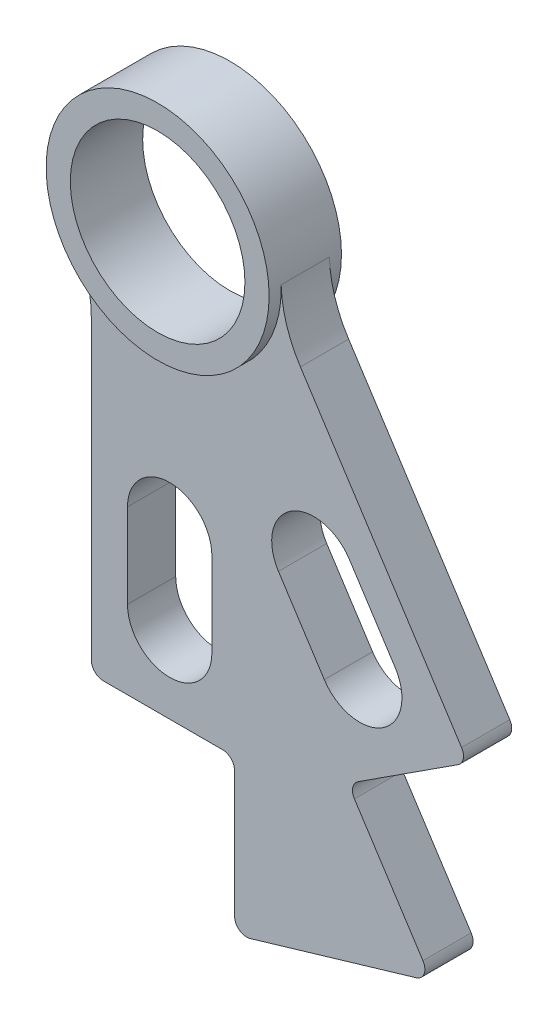
ISO-10303-21;
HEADER;
FILE_DESCRIPTION(('STEP AP214'),'2;1');
FILE_NAME('part.step','',(''),(''),'','','');
FILE_SCHEMA(('AUTOMOTIVE_DESIGN { 1 0 10303 214 1 1 1 1 }'));
ENDSEC;
DATA;
#1=APPLICATION_CONTEXT('core data for automotive mechanical design processes');
#2=APPLICATION_PROTOCOL_DEFINITION('international standard','automotive_design',2000,#1);
#3=PRODUCT_CONTEXT('',#1,'mechanical');
#4=PRODUCT('Part','Part','',(#3));
#5=PRODUCT_RELATED_PRODUCT_CATEGORY('part','',(#4));
#6=PRODUCT_DEFINITION_FORMATION('','',#4);
#7=PRODUCT_DEFINITION_CONTEXT('part definition',#1,'design');
#8=PRODUCT_DEFINITION('design','',#6,#7);
#9=PRODUCT_DEFINITION_SHAPE('','',#8);
#10=(LENGTH_UNIT() NAMED_UNIT(*) SI_UNIT(.MILLI.,.METRE.));
#11=(NAMED_UNIT(*) PLANE_ANGLE_UNIT() SI_UNIT($,.RADIAN.));
#12=(NAMED_UNIT(*) SI_UNIT($,.STERADIAN.) SOLID_ANGLE_UNIT());
#13=UNCERTAINTY_MEASURE_WITH_UNIT(LENGTH_MEASURE(1.E-05),#10,'distance_accuracy_value','');
#14=(GEOMETRIC_REPRESENTATION_CONTEXT(3) GLOBAL_UNCERTAINTY_ASSIGNED_CONTEXT((#13)) GLOBAL_UNIT_ASSIGNED_CONTEXT((#10,
#11,#12)) REPRESENTATION_CONTEXT('',''));
#15=CARTESIAN_POINT('',(0.,0.,0.));
#16=DIRECTION('',(0.,0.,1.));
#17=DIRECTION('',(1.,0.,0.));
#18=AXIS2_PLACEMENT_3D('',#15,#16,#17);
#19=CARTESIAN_POINT('',(0.,0.,4.7625));
#20=DIRECTION('',(0.,0.,-1.));
#21=DIRECTION('',(-1.,0.,0.));
#22=AXIS2_PLACEMENT_3D('',#19,#20,#21);
#23=CYLINDRICAL_SURFACE('',#22,11.495405);
#24=CARTESIAN_POINT('',(0.,0.,4.7625));
#25=DIRECTION('',(0.,0.,1.));
#26=DIRECTION('',(1.,0.,0.));
#27=AXIS2_PLACEMENT_3D('',#24,#25,#26);
#28=CIRCLE('',#27,11.495405);
#29=CARTESIAN_POINT('',(11.495405,0.,4.7625));
#30=VERTEX_POINT('',#29);
#31=EDGE_CURVE('E337',#30,#30,#28,.T.);
#32=ORIENTED_EDGE('',*,*,#31,.T.);
#33=EDGE_LOOP('',(#32));
#34=FACE_BOUND('',#33,.T.);
#35=CARTESIAN_POINT('',(0.,0.,-4.7625));
#36=DIRECTION('',(0.,0.,1.));
#37=DIRECTION('',(1.,0.,0.));
#38=AXIS2_PLACEMENT_3D('',#35,#36,#37);
#39=CIRCLE('',#38,11.495405);
#40=CARTESIAN_POINT('',(11.495405,0.,-4.7625));
#41=VERTEX_POINT('',#40);
#42=EDGE_CURVE('E325',#41,#41,#39,.T.);
#43=ORIENTED_EDGE('',*,*,#42,.F.);
#44=EDGE_LOOP('',(#43));
#45=FACE_BOUND('',#44,.T.);
#46=ADVANCED_FACE('F35',(#34,#45),#23,.F.);
#47=CARTESIAN_POINT('',(0.,0.,4.7625));
#48=DIRECTION('',(0.,0.,-1.));
#49=DIRECTION('',(-1.,0.,0.));
#50=AXIS2_PLACEMENT_3D('',#47,#48,#49);
#51=CYLINDRICAL_SURFACE('',#50,14.6812);
#52=DIRECTION('',(0.,0.,-1.));
#53=VECTOR('',#52,1.);
#54=CARTESIAN_POINT('',(-12.5851932668327,-7.5597978727258,3.175));
#55=LINE('',#54,#53);
#56=CARTESIAN_POINT('',(-12.5851932668327,-7.5597978727258,3.175));
#57=VERTEX_POINT('',#56);
#58=CARTESIAN_POINT('',(-12.5851932668327,-7.5597978727258,-3.175));
#59=VERTEX_POINT('',#58);
#60=EDGE_CURVE('E333',#57,#59,#55,.T.);
#61=ORIENTED_EDGE('',*,*,#60,.F.);
#62=CARTESIAN_POINT('',(0.,0.,3.175));
#63=DIRECTION('',(0.,0.,1.));
#64=DIRECTION('',(1.,0.,0.));
#65=AXIS2_PLACEMENT_3D('',#62,#63,#64);
#66=CIRCLE('',#65,14.6812);
#67=CARTESIAN_POINT('',(14.6729838648991,0.491098707400019,3.175));
#68=VERTEX_POINT('',#67);
#69=EDGE_CURVE('E225',#57,#68,#66,.T.);
#70=ORIENTED_EDGE('',*,*,#69,.T.);
#71=DIRECTION('',(0.,0.,-1.));
#72=VECTOR('',#71,1.);
#73=CARTESIAN_POINT('',(14.6729838648991,0.491098707400019,3.175));
#74=LINE('',#73,#72);
#75=CARTESIAN_POINT('',(14.6729838648991,0.491098707400019,-3.175));
#76=VERTEX_POINT('',#75);
#77=EDGE_CURVE('E222',#68,#76,#74,.T.);
#78=ORIENTED_EDGE('',*,*,#77,.T.);
#79=CARTESIAN_POINT('',(0.,0.,-3.175));
#80=DIRECTION('',(0.,0.,1.));
#81=DIRECTION('',(1.,0.,0.));
#82=AXIS2_PLACEMENT_3D('',#79,#80,#81);
#83=CIRCLE('',#82,14.6812);
#84=EDGE_CURVE('E274',#59,#76,#83,.T.);
#85=ORIENTED_EDGE('',*,*,#84,.F.);
#86=EDGE_LOOP('',(#61,#70,#78,#85));
#87=FACE_BOUND('',#86,.T.);
#88=CARTESIAN_POINT('',(0.,0.,4.7625));
#89=DIRECTION('',(0.,0.,1.));
#90=DIRECTION('',(1.,0.,0.));
#91=AXIS2_PLACEMENT_3D('',#88,#89,#90);
#92=CIRCLE('',#91,14.6812);
#93=CARTESIAN_POINT('',(14.6812,0.,4.7625));
#94=VERTEX_POINT('',#93);
#95=EDGE_CURVE('E340',#94,#94,#92,.T.);
#96=ORIENTED_EDGE('',*,*,#95,.F.);
#97=EDGE_LOOP('',(#96));
#98=FACE_BOUND('',#97,.T.);
#99=CARTESIAN_POINT('',(0.,0.,-4.7625));
#100=DIRECTION('',(0.,0.,1.));
#101=DIRECTION('',(1.,0.,0.));
#102=AXIS2_PLACEMENT_3D('',#99,#100,#101);
#103=CIRCLE('',#102,14.6812);
#104=CARTESIAN_POINT('',(14.6812,0.,-4.7625));
#105=VERTEX_POINT('',#104);
#106=EDGE_CURVE('E341',#105,#105,#103,.T.);
#107=ORIENTED_EDGE('',*,*,#106,.T.);
#108=EDGE_LOOP('',(#107));
#109=FACE_BOUND('',#108,.T.);
#110=ADVANCED_FACE('F438',(#87,#98,#109),#51,.T.);
#111=CARTESIAN_POINT('',(0.,0.,4.7625));
#112=DIRECTION('',(0.,0.,1.));
#113=DIRECTION('',(1.,0.,0.));
#114=AXIS2_PLACEMENT_3D('',#111,#112,#113);
#115=PLANE('',#114);
#116=ORIENTED_EDGE('',*,*,#31,.F.);
#117=EDGE_LOOP('',(#116));
#118=FACE_BOUND('',#117,.T.);
#119=ORIENTED_EDGE('',*,*,#95,.T.);
#120=EDGE_LOOP('',(#119));
#121=FACE_BOUND('',#120,.T.);
#122=ADVANCED_FACE('F463',(#118,#121),#115,.T.);
#123=CARTESIAN_POINT('',(0.,0.,-4.7625));
#124=DIRECTION('',(0.,0.,1.));
#125=DIRECTION('',(1.,0.,0.));
#126=AXIS2_PLACEMENT_3D('',#123,#124,#125);
#127=PLANE('',#126);
#128=ORIENTED_EDGE('',*,*,#42,.T.);
#129=EDGE_LOOP('',(#128));
#130=FACE_BOUND('',#129,.T.);
#131=ORIENTED_EDGE('',*,*,#106,.F.);
#132=EDGE_LOOP('',(#131));
#133=FACE_BOUND('',#132,.T.);
#134=ADVANCED_FACE('F672',(#130,#133),#127,.F.);
#135=CARTESIAN_POINT('',(0.,-34.9430697939241,3.175));
#136=DIRECTION('',(0.,0.,-1.));
#137=DIRECTION('',(-1.,0.,0.));
#138=AXIS2_PLACEMENT_3D('',#135,#136,#137);
#139=CYLINDRICAL_SURFACE('',#138,5.55625000000368);
#140=CARTESIAN_POINT('',(0.,-34.9430697939241,-3.175));
#141=DIRECTION('',(0.,0.,1.));
#142=DIRECTION('',(1.,0.,0.));
#143=AXIS2_PLACEMENT_3D('',#140,#141,#142);
#144=CIRCLE('',#143,5.55625000000368);
#145=CARTESIAN_POINT('',(5.55625000000371,-34.9430697939241,-3.175));
#146=VERTEX_POINT('',#145);
#147=CARTESIAN_POINT('',(-5.55625000000365,-34.9430697939241,-3.175));
#148=VERTEX_POINT('',#147);
#149=EDGE_CURVE('E303',#146,#148,#144,.T.);
#150=ORIENTED_EDGE('',*,*,#149,.F.);
#151=DIRECTION('',(0.,0.,-1.));
#152=VECTOR('',#151,1.);
#153=CARTESIAN_POINT('',(5.55625000000371,-34.9430697939241,3.175));
#154=LINE('',#153,#152);
#155=CARTESIAN_POINT('',(5.55625000000371,-34.9430697939241,3.175));
#156=VERTEX_POINT('',#155);
#157=EDGE_CURVE('E323',#156,#146,#154,.T.);
#158=ORIENTED_EDGE('',*,*,#157,.F.);
#159=CARTESIAN_POINT('',(0.,-34.9430697939241,3.175));
#160=DIRECTION('',(0.,0.,1.));
#161=DIRECTION('',(1.,0.,0.));
#162=AXIS2_PLACEMENT_3D('',#159,#160,#161);
#163=CIRCLE('',#162,5.55625000000368);
#164=CARTESIAN_POINT('',(-5.55625000000365,-34.9430697939241,3.175));
#165=VERTEX_POINT('',#164);
#166=EDGE_CURVE('E253',#156,#165,#163,.T.);
#167=ORIENTED_EDGE('',*,*,#166,.T.);
#168=DIRECTION('',(0.,0.,-1.));
#169=VECTOR('',#168,1.);
#170=CARTESIAN_POINT('',(-5.55625000000365,-34.9430697939241,3.175));
#171=LINE('',#170,#169);
#172=EDGE_CURVE('E316',#165,#148,#171,.T.);
#173=ORIENTED_EDGE('',*,*,#172,.T.);
#174=EDGE_LOOP('',(#150,#158,#167,#173));
#175=FACE_BOUND('',#174,.T.);
#176=ADVANCED_FACE('F662',(#175),#139,.F.);
#177=CARTESIAN_POINT('',(5.55625000000371,0.,3.175));
#178=DIRECTION('',(-1.,0.,0.));
#179=DIRECTION('',(0.,0.,1.));
#180=AXIS2_PLACEMENT_3D('',#177,#178,#179);
#181=PLANE('',#180);
#182=DIRECTION('',(0.,1.,0.));
#183=VECTOR('',#182,1.);
#184=CARTESIAN_POINT('',(5.55625000000371,0.,-3.175));
#185=LINE('',#184,#183);
#186=CARTESIAN_POINT('',(5.55625000000371,-46.0555697939241,-3.175));
#187=VERTEX_POINT('',#186);
#188=EDGE_CURVE('E306',#187,#146,#185,.T.);
#189=ORIENTED_EDGE('',*,*,#188,.F.);
#190=DIRECTION('',(0.,0.,-1.));
#191=VECTOR('',#190,1.);
#192=CARTESIAN_POINT('',(5.55625000000371,-46.0555697939241,3.175));
#193=LINE('',#192,#191);
#194=CARTESIAN_POINT('',(5.55625000000371,-46.0555697939241,3.175));
#195=VERTEX_POINT('',#194);
#196=EDGE_CURVE('E321',#195,#187,#193,.T.);
#197=ORIENTED_EDGE('',*,*,#196,.F.);
#198=DIRECTION('',(0.,1.,0.));
#199=VECTOR('',#198,1.);
#200=CARTESIAN_POINT('',(5.55625000000371,0.,3.175));
#201=LINE('',#200,#199);
#202=EDGE_CURVE('E256',#195,#156,#201,.T.);
#203=ORIENTED_EDGE('',*,*,#202,.T.);
#204=ORIENTED_EDGE('',*,*,#157,.T.);
#205=EDGE_LOOP('',(#189,#197,#203,#204));
#206=FACE_BOUND('',#205,.T.);
#207=ADVANCED_FACE('F652',(#206),#181,.T.);
#208=CARTESIAN_POINT('',(0.,-46.0555697939241,3.175));
#209=DIRECTION('',(0.,0.,-1.));
#210=DIRECTION('',(-1.,0.,0.));
#211=AXIS2_PLACEMENT_3D('',#208,#209,#210);
#212=CYLINDRICAL_SURFACE('',#211,5.55625000000368);
#213=CARTESIAN_POINT('',(0.,-46.0555697939241,-3.175));
#214=DIRECTION('',(0.,0.,1.));
#215=DIRECTION('',(1.,0.,0.));
#216=AXIS2_PLACEMENT_3D('',#213,#214,#215);
#217=CIRCLE('',#216,5.55625000000368);
#218=CARTESIAN_POINT('',(-5.55625000000365,-46.0555697939241,-3.175));
#219=VERTEX_POINT('',#218);
#220=EDGE_CURVE('E309',#219,#187,#217,.T.);
#221=ORIENTED_EDGE('',*,*,#220,.F.);
#222=DIRECTION('',(0.,0.,-1.));
#223=VECTOR('',#222,1.);
#224=CARTESIAN_POINT('',(-5.55625000000365,-46.0555697939241,3.175));
#225=LINE('',#224,#223);
#226=CARTESIAN_POINT('',(-5.55625000000365,-46.0555697939241,3.175));
#227=VERTEX_POINT('',#226);
#228=EDGE_CURVE('E318',#227,#219,#225,.T.);
#229=ORIENTED_EDGE('',*,*,#228,.F.);
#230=CARTESIAN_POINT('',(0.,-46.0555697939241,3.175));
#231=DIRECTION('',(0.,0.,1.));
#232=DIRECTION('',(1.,0.,0.));
#233=AXIS2_PLACEMENT_3D('',#230,#231,#232);
#234=CIRCLE('',#233,5.55625000000368);
#235=EDGE_CURVE('E259',#227,#195,#234,.T.);
#236=ORIENTED_EDGE('',*,*,#235,.T.);
#237=ORIENTED_EDGE('',*,*,#196,.T.);
#238=EDGE_LOOP('',(#221,#229,#236,#237));
#239=FACE_BOUND('',#238,.T.);
#240=ADVANCED_FACE('F642',(#239),#212,.F.);
#241=CARTESIAN_POINT('',(18.9851807063147,-29.3356615772007,3.175));
#242=DIRECTION('',(0.,0.,-1.));
#243=DIRECTION('',(-1.,0.,0.));
#244=AXIS2_PLACEMENT_3D('',#241,#242,#243);
#245=CYLINDRICAL_SURFACE('',#244,5.55625000000375);
#246=CARTESIAN_POINT('',(18.9851807063147,-29.3356615772007,-3.175));
#247=DIRECTION('',(0.,0.,1.));
#248=DIRECTION('',(1.,0.,0.));
#249=AXIS2_PLACEMENT_3D('',#246,#247,#248);
#250=CIRCLE('',#249,5.55625000000375);
#251=CARTESIAN_POINT('',(23.6498043527107,-26.3168538158445,-3.175));
#252=VERTEX_POINT('',#251);
#253=CARTESIAN_POINT('',(14.3205570599188,-32.3544693385572,-3.175));
#254=VERTEX_POINT('',#253);
#255=EDGE_CURVE('E291',#252,#254,#250,.T.);
#256=ORIENTED_EDGE('',*,*,#255,.F.);
#257=DIRECTION('',(0.,0.,-1.));
#258=VECTOR('',#257,1.);
#259=CARTESIAN_POINT('',(23.6498043527107,-26.3168538158445,3.175));
#260=LINE('',#259,#258);
#261=CARTESIAN_POINT('',(23.6498043527107,-26.3168538158445,3.175));
#262=VERTEX_POINT('',#261);
#263=EDGE_CURVE('E319',#262,#252,#260,.T.);
#264=ORIENTED_EDGE('',*,*,#263,.F.);
#265=CARTESIAN_POINT('',(18.9851807063147,-29.3356615772007,3.175));
#266=DIRECTION('',(0.,0.,1.));
#267=DIRECTION('',(1.,0.,0.));
#268=AXIS2_PLACEMENT_3D('',#265,#266,#267);
#269=CIRCLE('',#268,5.55625000000375);
#270=CARTESIAN_POINT('',(14.3205570599188,-32.3544693385572,3.175));
#271=VERTEX_POINT('',#270);
#272=EDGE_CURVE('E242',#262,#271,#269,.T.);
#273=ORIENTED_EDGE('',*,*,#272,.T.);
#274=DIRECTION('',(0.,0.,-1.));
#275=VECTOR('',#274,1.);
#276=CARTESIAN_POINT('',(14.3205570599188,-32.3544693385572,3.175));
#277=LINE('',#276,#275);
#278=EDGE_CURVE('E221',#271,#254,#277,.T.);
#279=ORIENTED_EDGE('',*,*,#278,.T.);
#280=EDGE_LOOP('',(#256,#264,#273,#279));
#281=FACE_BOUND('',#280,.T.);
#282=ADVANCED_FACE('F632',(#281),#245,.F.);
#283=CARTESIAN_POINT('',(4.66462364639593,3.0188077613563,3.175));
#284=DIRECTION('',(-0.839527315436279,-0.543317482358478,0.));
#285=DIRECTION('',(0.543317482358478,-0.839527315436279,0.));
#286=AXIS2_PLACEMENT_3D('',#283,#284,#285);
#287=PLANE('',#286);
#288=DIRECTION('',(-0.543317482358478,0.839527315436279,0.));
#289=VECTOR('',#288,1.);
#290=CARTESIAN_POINT('',(4.66462364639593,3.0188077613563,-3.175));
#291=LINE('',#290,#289);
#292=CARTESIAN_POINT('',(29.6874198754193,-35.6461011086302,-3.175));
#293=VERTEX_POINT('',#292);
#294=EDGE_CURVE('E294',#293,#252,#291,.T.);
#295=ORIENTED_EDGE('',*,*,#294,.F.);
#296=DIRECTION('',(0.,0.,-1.));
#297=VECTOR('',#296,1.);
#298=CARTESIAN_POINT('',(29.6874198754193,-35.6461011086302,3.175));
#299=LINE('',#298,#297);
#300=CARTESIAN_POINT('',(29.6874198754193,-35.6461011086302,3.175));
#301=VERTEX_POINT('',#300);
#302=EDGE_CURVE('E329',#301,#293,#299,.T.);
#303=ORIENTED_EDGE('',*,*,#302,.F.);
#304=DIRECTION('',(-0.543317482358478,0.839527315436279,0.));
#305=VECTOR('',#304,1.);
#306=CARTESIAN_POINT('',(4.66462364639593,3.0188077613563,3.175));
#307=LINE('',#306,#305);
#308=EDGE_CURVE('E245',#301,#262,#307,.T.);
#309=ORIENTED_EDGE('',*,*,#308,.T.);
#310=ORIENTED_EDGE('',*,*,#263,.T.);
#311=EDGE_LOOP('',(#295,#303,#309,#310));
#312=FACE_BOUND('',#311,.T.);
#313=ADVANCED_FACE('F622',(#312),#287,.T.);
#314=CARTESIAN_POINT('',(25.0227962290233,-38.6649088699864,3.175));
#315=DIRECTION('',(0.,0.,-1.));
#316=DIRECTION('',(-1.,0.,0.));
#317=AXIS2_PLACEMENT_3D('',#314,#315,#316);
#318=CYLINDRICAL_SURFACE('',#317,5.55625000000375);
#319=CARTESIAN_POINT('',(25.0227962290233,-38.6649088699864,-3.175));
#320=DIRECTION('',(0.,0.,1.));
#321=DIRECTION('',(1.,0.,0.));
#322=AXIS2_PLACEMENT_3D('',#319,#320,#321);
#323=CIRCLE('',#322,5.55625000000375);
#324=CARTESIAN_POINT('',(20.3581725826273,-41.6837166313428,-3.175));
#325=VERTEX_POINT('',#324);
#326=EDGE_CURVE('E297',#325,#293,#323,.T.);
#327=ORIENTED_EDGE('',*,*,#326,.F.);
#328=DIRECTION('',(0.,0.,-1.));
#329=VECTOR('',#328,1.);
#330=CARTESIAN_POINT('',(20.3581725826273,-41.6837166313428,3.175));
#331=LINE('',#330,#329);
#332=CARTESIAN_POINT('',(20.3581725826273,-41.6837166313428,3.175));
#333=VERTEX_POINT('',#332);
#334=EDGE_CURVE('E327',#333,#325,#331,.T.);
#335=ORIENTED_EDGE('',*,*,#334,.F.);
#336=CARTESIAN_POINT('',(25.0227962290233,-38.6649088699864,3.175));
#337=DIRECTION('',(0.,0.,1.));
#338=DIRECTION('',(1.,0.,0.));
#339=AXIS2_PLACEMENT_3D('',#336,#337,#338);
#340=CIRCLE('',#339,5.55625000000375);
#341=EDGE_CURVE('E248',#333,#301,#340,.T.);
#342=ORIENTED_EDGE('',*,*,#341,.T.);
#343=ORIENTED_EDGE('',*,*,#302,.T.);
#344=EDGE_LOOP('',(#327,#335,#342,#343));
#345=FACE_BOUND('',#344,.T.);
#346=ADVANCED_FACE('F588',(#345),#318,.F.);
#347=CARTESIAN_POINT('',(-7.17019291931249,-4.64033878745323,3.175));
#348=DIRECTION('',(0.839527315436278,0.543317482358478,0.));
#349=DIRECTION('',(-0.543317482358479,0.839527315436278,0.));
#350=AXIS2_PLACEMENT_3D('',#347,#348,#349);
#351=PLANE('',#350);
#352=DIRECTION('',(0.543317482358479,-0.839527315436278,0.));
#353=VECTOR('',#352,1.);
#354=CARTESIAN_POINT('',(-7.17019291931249,-4.64033878745323,3.175));
#355=LINE('',#354,#353);
#356=CARTESIAN_POINT('',(24.3214770840415,-53.3008697568528,3.175));
#357=VERTEX_POINT('',#356);
#358=CARTESIAN_POINT('',(33.3450702928547,-67.2440120781699,3.175));
#359=VERTEX_POINT('',#358);
#360=EDGE_CURVE('E315',#357,#359,#355,.T.);
#361=ORIENTED_EDGE('',*,*,#360,.T.);
#362=DIRECTION('',(0.,0.,-1.));
#363=VECTOR('',#362,1.);
#364=CARTESIAN_POINT('',(33.3450702928547,-67.2440120781699,-3.175));
#365=LINE('',#364,#363);
#366=CARTESIAN_POINT('',(33.3450702928547,-67.2440120781699,-3.175));
#367=VERTEX_POINT('',#366);
#368=EDGE_CURVE('E374',#359,#367,#365,.T.);
#369=ORIENTED_EDGE('',*,*,#368,.T.);
#370=DIRECTION('',(0.543317482358479,-0.839527315436278,0.));
#371=VECTOR('',#370,1.);
#372=CARTESIAN_POINT('',(-7.17019291931249,-4.64033878745323,-3.175));
#373=LINE('',#372,#371);
#374=CARTESIAN_POINT('',(24.3214770840415,-53.3008697568528,-3.175));
#375=VERTEX_POINT('',#374);
#376=EDGE_CURVE('E265',#375,#367,#373,.T.);
#377=ORIENTED_EDGE('',*,*,#376,.F.);
#378=DIRECTION('',(0.,0.,-1.));
#379=VECTOR('',#378,1.);
#380=CARTESIAN_POINT('',(24.3214770840415,-53.3008697568528,3.175));
#381=LINE('',#380,#379);
#382=EDGE_CURVE('E372',#375,#357,#381,.F.);
#383=ORIENTED_EDGE('',*,*,#382,.T.);
#384=EDGE_LOOP('',(#361,#369,#377,#383));
#385=FACE_BOUND('',#384,.T.);
#386=ADVANCED_FACE('F425',(#385),#351,.T.);
#387=CARTESIAN_POINT('',(30.6291535001097,-47.3277813561446,3.175));
#388=DIRECTION('',(-0.543317482358476,0.83952731543628,0.));
#389=DIRECTION('',(-0.83952731543628,-0.543317482358476,0.));
#390=AXIS2_PLACEMENT_3D('',#387,#388,#389);
#391=PLANE('',#390);
#392=DIRECTION('',(0.83952731543628,0.543317482358476,0.));
#393=VECTOR('',#392,1.);
#394=CARTESIAN_POINT('',(30.6291535001097,-47.3277813561446,3.175));
#395=LINE('',#394,#393);
#396=CARTESIAN_POINT('',(24.7917101940525,-51.1056036403536,3.175));
#397=VERTEX_POINT('',#396);
#398=CARTESIAN_POINT('',(37.9592763730128,-42.5839405883021,3.175));
#399=VERTEX_POINT('',#398);
#400=EDGE_CURVE('E211',#397,#399,#395,.T.);
#401=ORIENTED_EDGE('',*,*,#400,.F.);
#402=DIRECTION('',(0.,0.,-1.));
#403=VECTOR('',#402,1.);
#404=CARTESIAN_POINT('',(24.7917101940525,-51.1056036403536,3.175));
#405=LINE('',#404,#403);
#406=CARTESIAN_POINT('',(24.7917101940525,-51.1056036403536,-3.175));
#407=VERTEX_POINT('',#406);
#408=EDGE_CURVE('E379',#397,#407,#405,.T.);
#409=ORIENTED_EDGE('',*,*,#408,.T.);
#410=DIRECTION('',(0.83952731543628,0.543317482358476,0.));
#411=VECTOR('',#410,1.);
#412=CARTESIAN_POINT('',(30.6291535001097,-47.3277813561446,-3.175));
#413=LINE('',#412,#411);
#414=CARTESIAN_POINT('',(37.9592763730128,-42.5839405883021,-3.175));
#415=VERTEX_POINT('',#414);
#416=EDGE_CURVE('E268',#407,#415,#413,.T.);
#417=ORIENTED_EDGE('',*,*,#416,.T.);
#418=DIRECTION('',(0.,0.,-1.));
#419=VECTOR('',#418,1.);
#420=CARTESIAN_POINT('',(37.9592763730128,-42.5839405883021,3.175));
#421=LINE('',#420,#419);
#422=EDGE_CURVE('E377',#415,#399,#421,.F.);
#423=ORIENTED_EDGE('',*,*,#422,.T.);
#424=EDGE_LOOP('',(#401,#409,#417,#423));
#425=FACE_BOUND('',#424,.T.);
#426=ADVANCED_FACE('F569',(#425),#391,.F.);
#427=CARTESIAN_POINT('',(8.66287248615812,5.60635727108654,3.175));
#428=DIRECTION('',(-0.839527315436279,-0.543317482358477,0.));
#429=DIRECTION('',(0.543317482358477,-0.83952731543628,0.));
#430=AXIS2_PLACEMENT_3D('',#427,#428,#429);
#431=PLANE('',#430);
#432=DIRECTION('',(-0.543317482358477,0.839527315436279,0.));
#433=VECTOR('',#432,1.);
#434=CARTESIAN_POINT('',(8.66287248615812,5.60635727108654,3.175));
#435=LINE('',#434,#433);
#436=CARTESIAN_POINT('',(38.4295094830239,-40.3886744718029,3.175));
#437=VERTEX_POINT('',#436);
#438=CARTESIAN_POINT('',(17.2116035032164,-7.60303398572287,3.175));
#439=VERTEX_POINT('',#438);
#440=EDGE_CURVE('E196',#437,#439,#435,.T.);
#441=ORIENTED_EDGE('',*,*,#440,.F.);
#442=DIRECTION('',(0.,0.,-1.));
#443=VECTOR('',#442,1.);
#444=CARTESIAN_POINT('',(38.4295094830238,-40.3886744718029,3.175));
#445=LINE('',#444,#443);
#446=CARTESIAN_POINT('',(38.4295094830239,-40.3886744718029,-3.175));
#447=VERTEX_POINT('',#446);
#448=EDGE_CURVE('E388',#437,#447,#445,.T.);
#449=ORIENTED_EDGE('',*,*,#448,.T.);
#450=DIRECTION('',(-0.543317482358477,0.839527315436279,0.));
#451=VECTOR('',#450,1.);
#452=CARTESIAN_POINT('',(8.66287248615812,5.60635727108654,-3.175));
#453=LINE('',#452,#451);
#454=CARTESIAN_POINT('',(17.2116035032164,-7.60303398572287,-3.175));
#455=VERTEX_POINT('',#454);
#456=EDGE_CURVE('E217',#447,#455,#453,.T.);
#457=ORIENTED_EDGE('',*,*,#456,.T.);
#458=DIRECTION('',(0.,0.,-1.));
#459=VECTOR('',#458,1.);
#460=CARTESIAN_POINT('',(17.2116035032164,-7.60303398572287,3.175));
#461=LINE('',#460,#459);
#462=EDGE_CURVE('E214',#439,#455,#461,.T.);
#463=ORIENTED_EDGE('',*,*,#462,.F.);
#464=EDGE_LOOP('',(#441,#449,#457,#463));
#465=FACE_BOUND('',#464,.T.);
#466=ADVANCED_FACE('F215',(#465),#431,.F.);
#467=CARTESIAN_POINT('',(30.5390996357642,1.02213104671653,3.175));
#468=DIRECTION('',(0.,0.,-1.));
#469=DIRECTION('',(-1.,0.,0.));
#470=AXIS2_PLACEMENT_3D('',#467,#468,#469);
#471=CYLINDRICAL_SURFACE('',#470,15.8749999999966);
#472=CARTESIAN_POINT('',(30.5390996357642,1.02213104671653,-3.175));
#473=DIRECTION('',(0.,0.,1.));
#474=DIRECTION('',(1.,0.,0.));
#475=AXIS2_PLACEMENT_3D('',#472,#473,#474);
#476=CIRCLE('',#475,15.8749999999966);
#477=EDGE_CURVE('E272',#455,#76,#476,.F.);
#478=ORIENTED_EDGE('',*,*,#477,.T.);
#479=ORIENTED_EDGE('',*,*,#77,.F.);
#480=CARTESIAN_POINT('',(30.5390996357642,1.02213104671653,3.175));
#481=DIRECTION('',(0.,0.,1.));
#482=DIRECTION('',(1.,0.,0.));
#483=AXIS2_PLACEMENT_3D('',#480,#481,#482);
#484=CIRCLE('',#483,15.8749999999966);
#485=EDGE_CURVE('E203',#439,#68,#484,.F.);
#486=ORIENTED_EDGE('',*,*,#485,.F.);
#487=ORIENTED_EDGE('',*,*,#462,.T.);
#488=EDGE_LOOP('',(#478,#479,#486,#487));
#489=FACE_BOUND('',#488,.T.);
#490=ADVANCED_FACE('F224',(#489),#471,.F.);
#491=CARTESIAN_POINT('',(-26.1937499999966,-15.7343197939241,3.175));
#492=DIRECTION('',(0.,0.,-1.));
#493=DIRECTION('',(-1.,0.,0.));
#494=AXIS2_PLACEMENT_3D('',#491,#492,#493);
#495=CYLINDRICAL_SURFACE('',#494,15.8749999999966);
#496=CARTESIAN_POINT('',(-26.1937499999966,-15.7343197939241,-3.175));
#497=DIRECTION('',(0.,0.,1.));
#498=DIRECTION('',(1.,0.,0.));
#499=AXIS2_PLACEMENT_3D('',#496,#497,#498);
#500=CIRCLE('',#499,15.8749999999966);
#501=CARTESIAN_POINT('',(-10.31875,-15.7343197939241,-3.175));
#502=VERTEX_POINT('',#501);
#503=EDGE_CURVE('E277',#502,#59,#500,.T.);
#504=ORIENTED_EDGE('',*,*,#503,.F.);
#505=DIRECTION('',(0.,0.,-1.));
#506=VECTOR('',#505,1.);
#507=CARTESIAN_POINT('',(-10.31875,-15.7343197939241,3.175));
#508=LINE('',#507,#506);
#509=CARTESIAN_POINT('',(-10.31875,-15.7343197939241,3.175));
#510=VERTEX_POINT('',#509);
#511=EDGE_CURVE('E264',#510,#502,#508,.T.);
#512=ORIENTED_EDGE('',*,*,#511,.F.);
#513=CARTESIAN_POINT('',(-26.1937499999966,-15.7343197939241,3.175));
#514=DIRECTION('',(0.,0.,1.));
#515=DIRECTION('',(1.,0.,0.));
#516=AXIS2_PLACEMENT_3D('',#513,#514,#515);
#517=CIRCLE('',#516,15.8749999999966);
#518=EDGE_CURVE('E227',#510,#57,#517,.T.);
#519=ORIENTED_EDGE('',*,*,#518,.T.);
#520=ORIENTED_EDGE('',*,*,#60,.T.);
#521=EDGE_LOOP('',(#504,#512,#519,#520));
#522=FACE_BOUND('',#521,.T.);
#523=ADVANCED_FACE('F441',(#522),#495,.F.);
#524=CARTESIAN_POINT('',(-10.31875,0.,3.175));
#525=DIRECTION('',(1.,0.,0.));
#526=DIRECTION('',(0.,0.,-1.));
#527=AXIS2_PLACEMENT_3D('',#524,#525,#526);
#528=PLANE('',#527);
#529=DIRECTION('',(0.,-1.,0.));
#530=VECTOR('',#529,1.);
#531=CARTESIAN_POINT('',(-10.31875,0.,-3.175));
#532=LINE('',#531,#530);
#533=CARTESIAN_POINT('',(-10.31875,-54.7868197939241,-3.175));
#534=VERTEX_POINT('',#533);
#535=EDGE_CURVE('E280',#502,#534,#532,.T.);
#536=ORIENTED_EDGE('',*,*,#535,.T.);
#537=DIRECTION('',(0.,0.,-1.));
#538=VECTOR('',#537,1.);
#539=CARTESIAN_POINT('',(-10.31875,-54.7868197939241,3.175));
#540=LINE('',#539,#538);
#541=CARTESIAN_POINT('',(-10.31875,-54.7868197939241,3.175));
#542=VERTEX_POINT('',#541);
#543=EDGE_CURVE('E386',#534,#542,#540,.F.);
#544=ORIENTED_EDGE('',*,*,#543,.T.);
#545=DIRECTION('',(0.,-1.,0.));
#546=VECTOR('',#545,1.);
#547=CARTESIAN_POINT('',(-10.31875,0.,3.175));
#548=LINE('',#547,#546);
#549=EDGE_CURVE('E233',#510,#542,#548,.T.);
#550=ORIENTED_EDGE('',*,*,#549,.F.);
#551=ORIENTED_EDGE('',*,*,#511,.T.);
#552=EDGE_LOOP('',(#536,#544,#550,#551));
#553=FACE_BOUND('',#552,.T.);
#554=ADVANCED_FACE('F448',(#553),#528,.F.);
#555=CARTESIAN_POINT('',(-2.65364309406162E-13,-56.3743197939242,3.175));
#556=DIRECTION('',(0.,1.,0.));
#557=DIRECTION('',(-1.,0.,0.));
#558=AXIS2_PLACEMENT_3D('',#555,#556,#557);
#559=PLANE('',#558);
#560=DIRECTION('',(1.,0.,0.));
#561=VECTOR('',#560,1.);
#562=CARTESIAN_POINT('',(-2.65364309406162E-13,-56.3743197939242,-3.175));
#563=LINE('',#562,#561);
#564=CARTESIAN_POINT('',(-8.73124999999998,-56.3743197939241,-3.175));
#565=VERTEX_POINT('',#564);
#566=CARTESIAN_POINT('',(6.95325000000004,-56.3743197939242,-3.175));
#567=VERTEX_POINT('',#566);
#568=EDGE_CURVE('E283',#565,#567,#563,.T.);
#569=ORIENTED_EDGE('',*,*,#568,.T.);
#570=DIRECTION('',(0.,0.,-1.));
#571=VECTOR('',#570,1.);
#572=CARTESIAN_POINT('',(6.95325000000004,-56.3743197939242,3.175));
#573=LINE('',#572,#571);
#574=CARTESIAN_POINT('',(6.95325000000004,-56.3743197939242,3.175));
#575=VERTEX_POINT('',#574);
#576=EDGE_CURVE('E50',#567,#575,#573,.F.);
#577=ORIENTED_EDGE('',*,*,#576,.T.);
#578=DIRECTION('',(1.,0.,0.));
#579=VECTOR('',#578,1.);
#580=CARTESIAN_POINT('',(-2.65364309406162E-13,-56.3743197939242,3.175));
#581=LINE('',#580,#579);
#582=CARTESIAN_POINT('',(-8.73124999999998,-56.3743197939241,3.175));
#583=VERTEX_POINT('',#582);
#584=EDGE_CURVE('E235',#583,#575,#581,.T.);
#585=ORIENTED_EDGE('',*,*,#584,.F.);
#586=DIRECTION('',(0.,0.,-1.));
#587=VECTOR('',#586,1.);
#588=CARTESIAN_POINT('',(-8.73124999999998,-56.3743197939241,3.175));
#589=LINE('',#588,#587);
#590=EDGE_CURVE('E382',#583,#565,#589,.T.);
#591=ORIENTED_EDGE('',*,*,#590,.T.);
#592=EDGE_LOOP('',(#569,#577,#585,#591));
#593=FACE_BOUND('',#592,.T.);
#594=ADVANCED_FACE('F401',(#593),#559,.F.);
#595=CARTESIAN_POINT('',(8.54075000000004,0.,3.175));
#596=DIRECTION('',(1.,0.,0.));
#597=DIRECTION('',(0.,1.,0.));
#598=AXIS2_PLACEMENT_3D('',#595,#596,#597);
#599=PLANE('',#598);
#600=DIRECTION('',(0.,-1.,0.));
#601=VECTOR('',#600,1.);
#602=CARTESIAN_POINT('',(8.54075000000004,0.,-3.175));
#603=LINE('',#602,#601);
#604=CARTESIAN_POINT('',(8.54075000000003,-57.9618197939242,-3.175));
#605=VERTEX_POINT('',#604);
#606=CARTESIAN_POINT('',(8.54075000000003,-74.5701445797258,-3.175));
#607=VERTEX_POINT('',#606);
#608=EDGE_CURVE('E285',#605,#607,#603,.T.);
#609=ORIENTED_EDGE('',*,*,#608,.T.);
#610=DIRECTION('',(0.,0.,-1.));
#611=VECTOR('',#610,1.);
#612=CARTESIAN_POINT('',(8.54075000000003,-74.5701445797258,3.175));
#613=LINE('',#612,#611);
#614=CARTESIAN_POINT('',(8.54075000000003,-74.5701445797258,3.175));
#615=VERTEX_POINT('',#614);
#616=EDGE_CURVE('E364',#607,#615,#613,.F.);
#617=ORIENTED_EDGE('',*,*,#616,.T.);
#618=DIRECTION('',(0.,-1.,0.));
#619=VECTOR('',#618,1.);
#620=CARTESIAN_POINT('',(8.54075000000004,0.,3.175));
#621=LINE('',#620,#619);
#622=CARTESIAN_POINT('',(8.54075000000003,-57.9618197939242,3.175));
#623=VERTEX_POINT('',#622);
#624=EDGE_CURVE('E237',#623,#615,#621,.T.);
#625=ORIENTED_EDGE('',*,*,#624,.F.);
#626=DIRECTION('',(0.,0.,-1.));
#627=VECTOR('',#626,1.);
#628=CARTESIAN_POINT('',(8.54075000000003,-57.9618197939242,-3.175));
#629=LINE('',#628,#627);
#630=EDGE_CURVE('E361',#623,#605,#629,.T.);
#631=ORIENTED_EDGE('',*,*,#630,.T.);
#632=EDGE_LOOP('',(#609,#617,#625,#631));
#633=FACE_BOUND('',#632,.T.);
#634=ADVANCED_FACE('F408',(#633),#599,.F.);
#635=CARTESIAN_POINT('',(-4.66462364639603,-3.01880776135636,3.175));
#636=DIRECTION('',(-0.839527315436279,-0.543317482358478,0.));
#637=DIRECTION('',(0.543317482358478,-0.839527315436279,0.));
#638=AXIS2_PLACEMENT_3D('',#635,#636,#637);
#639=PLANE('',#638);
#640=DIRECTION('',(-0.543317482358478,0.839527315436279,0.));
#641=VECTOR('',#640,1.);
#642=CARTESIAN_POINT('',(-4.66462364639603,-3.01880776135636,-3.175));
#643=LINE('',#642,#641);
#644=EDGE_CURVE('E300',#325,#254,#643,.T.);
#645=ORIENTED_EDGE('',*,*,#644,.T.);
#646=ORIENTED_EDGE('',*,*,#278,.F.);
#647=DIRECTION('',(-0.543317482358478,0.839527315436279,0.));
#648=VECTOR('',#647,1.);
#649=CARTESIAN_POINT('',(-4.66462364639603,-3.01880776135636,3.175));
#650=LINE('',#649,#648);
#651=EDGE_CURVE('E251',#333,#271,#650,.T.);
#652=ORIENTED_EDGE('',*,*,#651,.F.);
#653=ORIENTED_EDGE('',*,*,#334,.T.);
#654=EDGE_LOOP('',(#645,#646,#652,#653));
#655=FACE_BOUND('',#654,.T.);
#656=ADVANCED_FACE('F539',(#655),#639,.F.);
#657=CARTESIAN_POINT('',(21.5199609111444,-72.8608174935983,3.175));
#658=DIRECTION('',(-0.28326020243187,0.959043094818088,0.));
#659=DIRECTION('',(-0.959043094818088,-0.28326020243187,0.));
#660=AXIS2_PLACEMENT_3D('',#657,#658,#659);
#661=PLANE('',#660);
#662=DIRECTION('',(0.959043094818088,0.28326020243187,0.));
#663=VECTOR('',#662,1.);
#664=CARTESIAN_POINT('',(21.5199609111444,-72.8608174935983,3.175));
#665=LINE('',#664,#663);
#666=CARTESIAN_POINT('',(10.5779255713606,-76.0926254927495,3.175));
#667=VERTEX_POINT('',#666);
#668=CARTESIAN_POINT('',(32.4619962509602,-69.6290094944377,3.175));
#669=VERTEX_POINT('',#668);
#670=EDGE_CURVE('E239',#667,#669,#665,.T.);
#671=ORIENTED_EDGE('',*,*,#670,.F.);
#672=DIRECTION('',(0.,0.,-1.));
#673=VECTOR('',#672,1.);
#674=CARTESIAN_POINT('',(10.5779255713606,-76.0926254927495,3.175));
#675=LINE('',#674,#673);
#676=CARTESIAN_POINT('',(10.5779255713606,-76.0926254927495,-3.175));
#677=VERTEX_POINT('',#676);
#678=EDGE_CURVE('E350',#667,#677,#675,.T.);
#679=ORIENTED_EDGE('',*,*,#678,.T.);
#680=DIRECTION('',(0.959043094818088,0.28326020243187,0.));
#681=VECTOR('',#680,1.);
#682=CARTESIAN_POINT('',(21.5199609111444,-72.8608174935983,-3.175));
#683=LINE('',#682,#681);
#684=CARTESIAN_POINT('',(32.4619962509602,-69.6290094944377,-3.175));
#685=VERTEX_POINT('',#684);
#686=EDGE_CURVE('E288',#677,#685,#683,.T.);
#687=ORIENTED_EDGE('',*,*,#686,.T.);
#688=DIRECTION('',(0.,0.,-1.));
#689=VECTOR('',#688,1.);
#690=CARTESIAN_POINT('',(32.4619962509602,-69.6290094944377,3.175));
#691=LINE('',#690,#689);
#692=EDGE_CURVE('E344',#685,#669,#691,.F.);
#693=ORIENTED_EDGE('',*,*,#692,.T.);
#694=EDGE_LOOP('',(#671,#679,#687,#693));
#695=FACE_BOUND('',#694,.T.);
#696=ADVANCED_FACE('F416',(#695),#661,.F.);
#697=CARTESIAN_POINT('',(-5.55625000000365,0.,3.175));
#698=DIRECTION('',(-1.,0.,0.));
#699=DIRECTION('',(0.,0.,1.));
#700=AXIS2_PLACEMENT_3D('',#697,#698,#699);
#701=PLANE('',#700);
#702=DIRECTION('',(0.,1.,0.));
#703=VECTOR('',#702,1.);
#704=CARTESIAN_POINT('',(-5.55625000000365,0.,-3.175));
#705=LINE('',#704,#703);
#706=EDGE_CURVE('E312',#219,#148,#705,.T.);
#707=ORIENTED_EDGE('',*,*,#706,.T.);
#708=ORIENTED_EDGE('',*,*,#172,.F.);
#709=DIRECTION('',(0.,1.,0.));
#710=VECTOR('',#709,1.);
#711=CARTESIAN_POINT('',(-5.55625000000365,0.,3.175));
#712=LINE('',#711,#710);
#713=EDGE_CURVE('E262',#227,#165,#712,.T.);
#714=ORIENTED_EDGE('',*,*,#713,.F.);
#715=ORIENTED_EDGE('',*,*,#228,.T.);
#716=EDGE_LOOP('',(#707,#708,#714,#715));
#717=FACE_BOUND('',#716,.T.);
#718=ADVANCED_FACE('F528',(#717),#701,.F.);
#719=CARTESIAN_POINT('',(0.,0.,3.175));
#720=DIRECTION('',(0.,0.,1.));
#721=DIRECTION('',(1.,0.,0.));
#722=AXIS2_PLACEMENT_3D('',#719,#720,#721);
#723=PLANE('',#722);
#724=ORIENTED_EDGE('',*,*,#624,.T.);
#725=CARTESIAN_POINT('',(10.12825,-74.5701445797258,3.175));
#726=DIRECTION('',(0.,0.,1.));
#727=DIRECTION('',(1.,0.,0.));
#728=AXIS2_PLACEMENT_3D('',#725,#726,#727);
#729=CIRCLE('',#728,1.5875);
#730=EDGE_CURVE('E370',#615,#667,#729,.T.);
#731=ORIENTED_EDGE('',*,*,#730,.T.);
#732=ORIENTED_EDGE('',*,*,#670,.T.);
#733=CARTESIAN_POINT('',(32.0123206795996,-68.106528581414,3.175));
#734=DIRECTION('',(0.,0.,1.));
#735=DIRECTION('',(1.,0.,0.));
#736=AXIS2_PLACEMENT_3D('',#733,#734,#735);
#737=CIRCLE('',#736,1.5875);
#738=EDGE_CURVE('E368',#669,#359,#737,.T.);
#739=ORIENTED_EDGE('',*,*,#738,.T.);
#740=ORIENTED_EDGE('',*,*,#360,.F.);
#741=CARTESIAN_POINT('',(25.6542266972966,-52.4383532536087,3.175));
#742=DIRECTION('',(0.,0.,1.));
#743=DIRECTION('',(1.,0.,0.));
#744=AXIS2_PLACEMENT_3D('',#741,#742,#743);
#745=CIRCLE('',#744,1.5875);
#746=EDGE_CURVE('E392',#357,#397,#745,.F.);
#747=ORIENTED_EDGE('',*,*,#746,.T.);
#748=ORIENTED_EDGE('',*,*,#400,.T.);
#749=CARTESIAN_POINT('',(37.0967598697688,-41.251190975047,3.175));
#750=DIRECTION('',(0.,0.,1.));
#751=DIRECTION('',(1.,0.,0.));
#752=AXIS2_PLACEMENT_3D('',#749,#750,#751);
#753=CIRCLE('',#752,1.5875);
#754=EDGE_CURVE('E207',#399,#437,#753,.T.);
#755=ORIENTED_EDGE('',*,*,#754,.T.);
#756=ORIENTED_EDGE('',*,*,#440,.T.);
#757=ORIENTED_EDGE('',*,*,#485,.T.);
#758=ORIENTED_EDGE('',*,*,#69,.F.);
#759=ORIENTED_EDGE('',*,*,#518,.F.);
#760=ORIENTED_EDGE('',*,*,#549,.T.);
#761=CARTESIAN_POINT('',(-8.73124999999997,-54.7868197939241,3.175));
#762=DIRECTION('',(0.,0.,1.));
#763=DIRECTION('',(1.,0.,0.));
#764=AXIS2_PLACEMENT_3D('',#761,#762,#763);
#765=CIRCLE('',#764,1.5875);
#766=EDGE_CURVE('E57',#542,#583,#765,.T.);
#767=ORIENTED_EDGE('',*,*,#766,.T.);
#768=ORIENTED_EDGE('',*,*,#584,.T.);
#769=CARTESIAN_POINT('',(6.95325000000003,-57.9618197939242,3.175));
#770=DIRECTION('',(0.,0.,1.));
#771=DIRECTION('',(1.,0.,0.));
#772=AXIS2_PLACEMENT_3D('',#769,#770,#771);
#773=CIRCLE('',#772,1.5875);
#774=EDGE_CURVE('E11',#575,#623,#773,.F.);
#775=ORIENTED_EDGE('',*,*,#774,.T.);
#776=EDGE_LOOP('',(#724,#731,#732,#739,#740,#747,#748,#755,#756,#757,#758,#759,#760,#767,#768,#775));
#777=FACE_BOUND('',#776,.T.);
#778=ORIENTED_EDGE('',*,*,#272,.F.);
#779=ORIENTED_EDGE('',*,*,#308,.F.);
#780=ORIENTED_EDGE('',*,*,#341,.F.);
#781=ORIENTED_EDGE('',*,*,#651,.T.);
#782=EDGE_LOOP('',(#778,#779,#780,#781));
#783=FACE_BOUND('',#782,.T.);
#784=ORIENTED_EDGE('',*,*,#166,.F.);
#785=ORIENTED_EDGE('',*,*,#202,.F.);
#786=ORIENTED_EDGE('',*,*,#235,.F.);
#787=ORIENTED_EDGE('',*,*,#713,.T.);
#788=EDGE_LOOP('',(#784,#785,#786,#787));
#789=FACE_BOUND('',#788,.T.);
#790=ADVANCED_FACE('F199',(#777,#783,#789),#723,.T.);
#791=CARTESIAN_POINT('',(0.,0.,-3.175));
#792=DIRECTION('',(0.,0.,1.));
#793=DIRECTION('',(1.,0.,0.));
#794=AXIS2_PLACEMENT_3D('',#791,#792,#793);
#795=PLANE('',#794);
#796=ORIENTED_EDGE('',*,*,#686,.F.);
#797=CARTESIAN_POINT('',(10.12825,-74.5701445797258,-3.175));
#798=DIRECTION('',(0.,0.,1.));
#799=DIRECTION('',(1.,0.,0.));
#800=AXIS2_PLACEMENT_3D('',#797,#798,#799);
#801=CIRCLE('',#800,1.5875);
#802=EDGE_CURVE('E359',#677,#607,#801,.F.);
#803=ORIENTED_EDGE('',*,*,#802,.T.);
#804=ORIENTED_EDGE('',*,*,#608,.F.);
#805=CARTESIAN_POINT('',(6.95325000000003,-57.9618197939242,-3.175));
#806=DIRECTION('',(0.,0.,1.));
#807=DIRECTION('',(1.,0.,0.));
#808=AXIS2_PLACEMENT_3D('',#805,#806,#807);
#809=CIRCLE('',#808,1.5875);
#810=EDGE_CURVE('E43',#605,#567,#809,.T.);
#811=ORIENTED_EDGE('',*,*,#810,.T.);
#812=ORIENTED_EDGE('',*,*,#568,.F.);
#813=CARTESIAN_POINT('',(-8.73124999999997,-54.7868197939241,-3.175));
#814=DIRECTION('',(0.,0.,1.));
#815=DIRECTION('',(1.,0.,0.));
#816=AXIS2_PLACEMENT_3D('',#813,#814,#815);
#817=CIRCLE('',#816,1.5875);
#818=EDGE_CURVE('E355',#565,#534,#817,.F.);
#819=ORIENTED_EDGE('',*,*,#818,.T.);
#820=ORIENTED_EDGE('',*,*,#535,.F.);
#821=ORIENTED_EDGE('',*,*,#503,.T.);
#822=ORIENTED_EDGE('',*,*,#84,.T.);
#823=ORIENTED_EDGE('',*,*,#477,.F.);
#824=ORIENTED_EDGE('',*,*,#456,.F.);
#825=CARTESIAN_POINT('',(37.0967598697688,-41.251190975047,-3.175));
#826=DIRECTION('',(0.,0.,1.));
#827=DIRECTION('',(1.,0.,0.));
#828=AXIS2_PLACEMENT_3D('',#825,#826,#827);
#829=CIRCLE('',#828,1.5875);
#830=EDGE_CURVE('E353',#447,#415,#829,.F.);
#831=ORIENTED_EDGE('',*,*,#830,.T.);
#832=ORIENTED_EDGE('',*,*,#416,.F.);
#833=CARTESIAN_POINT('',(25.6542266972966,-52.4383532536087,-3.175));
#834=DIRECTION('',(0.,0.,1.));
#835=DIRECTION('',(1.,0.,0.));
#836=AXIS2_PLACEMENT_3D('',#833,#834,#835);
#837=CIRCLE('',#836,1.5875);
#838=EDGE_CURVE('E390',#407,#375,#837,.T.);
#839=ORIENTED_EDGE('',*,*,#838,.T.);
#840=ORIENTED_EDGE('',*,*,#376,.T.);
#841=CARTESIAN_POINT('',(32.0123206795996,-68.106528581414,-3.175));
#842=DIRECTION('',(0.,0.,1.));
#843=DIRECTION('',(1.,0.,0.));
#844=AXIS2_PLACEMENT_3D('',#841,#842,#843);
#845=CIRCLE('',#844,1.5875);
#846=EDGE_CURVE('E357',#367,#685,#845,.F.);
#847=ORIENTED_EDGE('',*,*,#846,.T.);
#848=EDGE_LOOP('',(#796,#803,#804,#811,#812,#819,#820,#821,#822,#823,#824,#831,#832,#839,#840,#847));
#849=FACE_BOUND('',#848,.T.);
#850=ORIENTED_EDGE('',*,*,#255,.T.);
#851=ORIENTED_EDGE('',*,*,#644,.F.);
#852=ORIENTED_EDGE('',*,*,#326,.T.);
#853=ORIENTED_EDGE('',*,*,#294,.T.);
#854=EDGE_LOOP('',(#850,#851,#852,#853));
#855=FACE_BOUND('',#854,.T.);
#856=ORIENTED_EDGE('',*,*,#149,.T.);
#857=ORIENTED_EDGE('',*,*,#706,.F.);
#858=ORIENTED_EDGE('',*,*,#220,.T.);
#859=ORIENTED_EDGE('',*,*,#188,.T.);
#860=EDGE_LOOP('',(#856,#857,#858,#859));
#861=FACE_BOUND('',#860,.T.);
#862=ADVANCED_FACE('F397',(#849,#855,#861),#795,.F.);
#863=CARTESIAN_POINT('',(10.12825,-74.5701445797258,3.175));
#864=DIRECTION('',(0.,0.,-1.));
#865=DIRECTION('',(-1.,0.,0.));
#866=AXIS2_PLACEMENT_3D('',#863,#864,#865);
#867=CYLINDRICAL_SURFACE('',#866,1.5875);
#868=ORIENTED_EDGE('',*,*,#730,.F.);
#869=ORIENTED_EDGE('',*,*,#616,.F.);
#870=ORIENTED_EDGE('',*,*,#802,.F.);
#871=ORIENTED_EDGE('',*,*,#678,.F.);
#872=EDGE_LOOP('',(#868,#869,#870,#871));
#873=FACE_BOUND('',#872,.T.);
#874=ADVANCED_FACE('F411',(#873),#867,.T.);
#875=CARTESIAN_POINT('',(32.0123206795996,-68.106528581414,3.175));
#876=DIRECTION('',(0.,0.,1.));
#877=DIRECTION('',(1.,0.,0.));
#878=AXIS2_PLACEMENT_3D('',#875,#876,#877);
#879=CYLINDRICAL_SURFACE('',#878,1.5875);
#880=ORIENTED_EDGE('',*,*,#738,.F.);
#881=ORIENTED_EDGE('',*,*,#692,.F.);
#882=ORIENTED_EDGE('',*,*,#846,.F.);
#883=ORIENTED_EDGE('',*,*,#368,.F.);
#884=EDGE_LOOP('',(#880,#881,#882,#883));
#885=FACE_BOUND('',#884,.T.);
#886=ADVANCED_FACE('F419',(#885),#879,.T.);
#887=CARTESIAN_POINT('',(25.6542266972966,-52.4383532536087,3.175));
#888=DIRECTION('',(0.,0.,-1.));
#889=DIRECTION('',(-1.,0.,0.));
#890=AXIS2_PLACEMENT_3D('',#887,#888,#889);
#891=CYLINDRICAL_SURFACE('',#890,1.5875);
#892=ORIENTED_EDGE('',*,*,#746,.F.);
#893=ORIENTED_EDGE('',*,*,#382,.F.);
#894=ORIENTED_EDGE('',*,*,#838,.F.);
#895=ORIENTED_EDGE('',*,*,#408,.F.);
#896=EDGE_LOOP('',(#892,#893,#894,#895));
#897=FACE_BOUND('',#896,.T.);
#898=ADVANCED_FACE('F472',(#897),#891,.F.);
#899=CARTESIAN_POINT('',(6.95325000000003,-57.9618197939242,3.175));
#900=DIRECTION('',(0.,0.,1.));
#901=DIRECTION('',(1.,0.,0.));
#902=AXIS2_PLACEMENT_3D('',#899,#900,#901);
#903=CYLINDRICAL_SURFACE('',#902,1.5875);
#904=ORIENTED_EDGE('',*,*,#774,.F.);
#905=ORIENTED_EDGE('',*,*,#576,.F.);
#906=ORIENTED_EDGE('',*,*,#810,.F.);
#907=ORIENTED_EDGE('',*,*,#630,.F.);
#908=EDGE_LOOP('',(#904,#905,#906,#907));
#909=FACE_BOUND('',#908,.T.);
#910=ADVANCED_FACE('F404',(#909),#903,.F.);
#911=CARTESIAN_POINT('',(-8.73124999999997,-54.7868197939241,3.175));
#912=DIRECTION('',(0.,0.,-1.));
#913=DIRECTION('',(-1.,0.,0.));
#914=AXIS2_PLACEMENT_3D('',#911,#912,#913);
#915=CYLINDRICAL_SURFACE('',#914,1.5875);
#916=ORIENTED_EDGE('',*,*,#766,.F.);
#917=ORIENTED_EDGE('',*,*,#543,.F.);
#918=ORIENTED_EDGE('',*,*,#818,.F.);
#919=ORIENTED_EDGE('',*,*,#590,.F.);
#920=EDGE_LOOP('',(#916,#917,#918,#919));
#921=FACE_BOUND('',#920,.T.);
#922=ADVANCED_FACE('F447',(#921),#915,.T.);
#923=CARTESIAN_POINT('',(37.0967598697688,-41.251190975047,3.175));
#924=DIRECTION('',(0.,0.,-1.));
#925=DIRECTION('',(-1.,0.,0.));
#926=AXIS2_PLACEMENT_3D('',#923,#924,#925);
#927=CYLINDRICAL_SURFACE('',#926,1.5875);
#928=ORIENTED_EDGE('',*,*,#754,.F.);
#929=ORIENTED_EDGE('',*,*,#422,.F.);
#930=ORIENTED_EDGE('',*,*,#830,.F.);
#931=ORIENTED_EDGE('',*,*,#448,.F.);
#932=EDGE_LOOP('',(#928,#929,#930,#931));
#933=FACE_BOUND('',#932,.T.);
#934=ADVANCED_FACE('F37',(#933),#927,.T.);
#935=CLOSED_SHELL('',(#46,#110,#122,#134,#176,#207,#240,#282,#313,#346,#386,#426,#466,#490,#523,
#554,#594,#634,#656,#696,#718,#790,#862,#874,#886,#898,#910,#922,#934));
#936=MANIFOLD_SOLID_BREP('B2',#935);
#937=ADVANCED_BREP_SHAPE_REPRESENTATION('',(#18,#936),#14);
#938=SHAPE_DEFINITION_REPRESENTATION(#9,#937);
ENDSEC;
END-ISO-10303-21;
